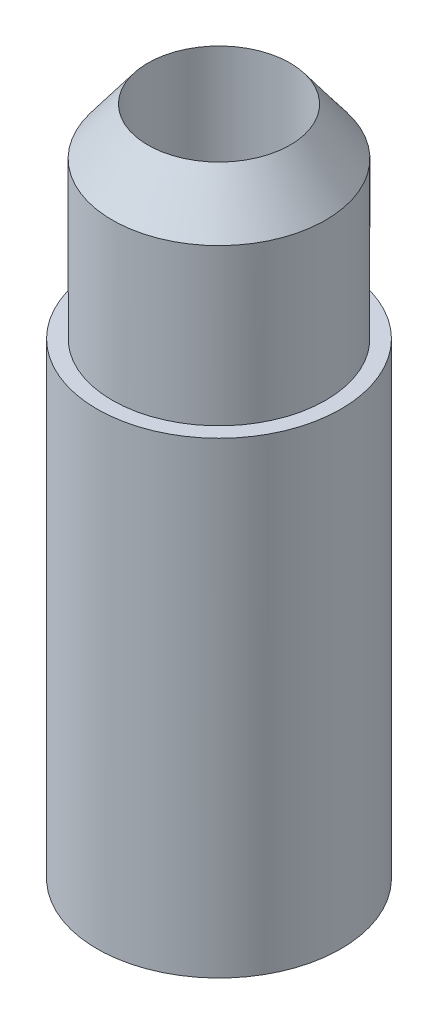
ISO-10303-21;
HEADER;
FILE_DESCRIPTION(('STEP AP214'),'2;1');
FILE_NAME('part.step','',(''),(''),'','','');
FILE_SCHEMA(('AUTOMOTIVE_DESIGN { 1 0 10303 214 1 1 1 1 }'));
ENDSEC;
DATA;
#1=APPLICATION_CONTEXT('core data for automotive mechanical design processes');
#2=APPLICATION_PROTOCOL_DEFINITION('international standard','automotive_design',2000,#1);
#3=PRODUCT_CONTEXT('',#1,'mechanical');
#4=PRODUCT('Part','Part','',(#3));
#5=PRODUCT_RELATED_PRODUCT_CATEGORY('part','',(#4));
#6=PRODUCT_DEFINITION_FORMATION('','',#4);
#7=PRODUCT_DEFINITION_CONTEXT('part definition',#1,'design');
#8=PRODUCT_DEFINITION('design','',#6,#7);
#9=PRODUCT_DEFINITION_SHAPE('','',#8);
#10=(LENGTH_UNIT() NAMED_UNIT(*) SI_UNIT(.MILLI.,.METRE.));
#11=(NAMED_UNIT(*) PLANE_ANGLE_UNIT() SI_UNIT($,.RADIAN.));
#12=(NAMED_UNIT(*) SI_UNIT($,.STERADIAN.) SOLID_ANGLE_UNIT());
#13=UNCERTAINTY_MEASURE_WITH_UNIT(LENGTH_MEASURE(1.E-05),#10,'distance_accuracy_value','');
#14=(GEOMETRIC_REPRESENTATION_CONTEXT(3) GLOBAL_UNCERTAINTY_ASSIGNED_CONTEXT((#13)) GLOBAL_UNIT_ASSIGNED_CONTEXT((#10,
#11,#12)) REPRESENTATION_CONTEXT('',''));
#15=CARTESIAN_POINT('',(0.,0.,0.));
#16=DIRECTION('',(0.,0.,1.));
#17=DIRECTION('',(1.,0.,0.));
#18=AXIS2_PLACEMENT_3D('',#15,#16,#17);
#19=CARTESIAN_POINT('',(0.,76.2,0.));
#20=DIRECTION('',(0.,-1.,0.));
#21=DIRECTION('',(0.,0.,-1.));
#22=AXIS2_PLACEMENT_3D('',#19,#20,#21);
#23=CYLINDRICAL_SURFACE('',#22,19.05);
#24=CARTESIAN_POINT('',(0.,76.2,0.));
#25=DIRECTION('',(0.,1.,0.));
#26=DIRECTION('',(0.,0.,1.));
#27=AXIS2_PLACEMENT_3D('',#24,#25,#26);
#28=CIRCLE('',#27,19.05);
#29=CARTESIAN_POINT('',(0.,76.2,19.05));
#30=VERTEX_POINT('',#29);
#31=EDGE_CURVE('E55',#30,#30,#28,.T.);
#32=ORIENTED_EDGE('',*,*,#31,.F.);
#33=EDGE_LOOP('',(#32));
#34=FACE_BOUND('',#33,.T.);
#35=CARTESIAN_POINT('',(0.,3.17499999999999,0.));
#36=DIRECTION('',(0.,-1.,0.));
#37=DIRECTION('',(0.,0.,-1.));
#38=AXIS2_PLACEMENT_3D('',#35,#36,#37);
#39=CIRCLE('',#38,19.05);
#40=CARTESIAN_POINT('',(0.,3.17499999999999,-19.05));
#41=VERTEX_POINT('',#40);
#42=EDGE_CURVE('E72',#41,#41,#39,.T.);
#43=ORIENTED_EDGE('',*,*,#42,.F.);
#44=EDGE_LOOP('',(#43));
#45=FACE_BOUND('',#44,.T.);
#46=ADVANCED_FACE('F47',(#34,#45),#23,.T.);
#47=CARTESIAN_POINT('',(0.,76.2,0.));
#48=DIRECTION('',(0.,-1.,0.));
#49=DIRECTION('',(0.,0.,-1.));
#50=AXIS2_PLACEMENT_3D('',#47,#48,#49);
#51=CYLINDRICAL_SURFACE('',#50,11.1125);
#52=CARTESIAN_POINT('',(0.,107.95,0.));
#53=DIRECTION('',(0.,-1.,0.));
#54=DIRECTION('',(0.,0.,-1.));
#55=AXIS2_PLACEMENT_3D('',#52,#53,#54);
#56=CIRCLE('',#55,11.1125);
#57=CARTESIAN_POINT('',(0.,107.95,-11.1125));
#58=VERTEX_POINT('',#57);
#59=EDGE_CURVE('E63',#58,#58,#56,.T.);
#60=ORIENTED_EDGE('',*,*,#59,.F.);
#61=EDGE_LOOP('',(#60));
#62=FACE_BOUND('',#61,.T.);
#63=CARTESIAN_POINT('',(0.,0.750684466478031,0.));
#64=DIRECTION('',(0.,1.,0.));
#65=DIRECTION('',(0.,0.,1.));
#66=AXIS2_PLACEMENT_3D('',#63,#64,#65);
#67=CIRCLE('',#66,11.1125);
#68=CARTESIAN_POINT('',(0.,0.750684466478031,11.1125));
#69=VERTEX_POINT('',#68);
#70=EDGE_CURVE('E50',#69,#69,#67,.F.);
#71=ORIENTED_EDGE('',*,*,#70,.T.);
#72=EDGE_LOOP('',(#71));
#73=FACE_BOUND('',#72,.T.);
#74=ADVANCED_FACE('F85',(#62,#73),#51,.F.);
#75=CARTESIAN_POINT('',(0.,76.2,0.));
#76=DIRECTION('',(0.,1.,0.));
#77=DIRECTION('',(0.,0.,1.));
#78=AXIS2_PLACEMENT_3D('',#75,#76,#77);
#79=PLANE('',#78);
#80=CARTESIAN_POINT('',(0.,76.2,0.));
#81=DIRECTION('',(0.,1.,0.));
#82=DIRECTION('',(0.,0.,1.));
#83=AXIS2_PLACEMENT_3D('',#80,#81,#82);
#84=CIRCLE('',#83,16.66875);
#85=CARTESIAN_POINT('',(0.,76.2,16.66875));
#86=VERTEX_POINT('',#85);
#87=EDGE_CURVE('E10',#86,#86,#84,.T.);
#88=ORIENTED_EDGE('',*,*,#87,.F.);
#89=EDGE_LOOP('',(#88));
#90=FACE_BOUND('',#89,.T.);
#91=ORIENTED_EDGE('',*,*,#31,.T.);
#92=EDGE_LOOP('',(#91));
#93=FACE_BOUND('',#92,.T.);
#94=ADVANCED_FACE('F102',(#90,#93),#79,.T.);
#95=CARTESIAN_POINT('',(0.,107.95,0.));
#96=DIRECTION('',(0.,-1.,0.));
#97=DIRECTION('',(0.,0.,-1.));
#98=AXIS2_PLACEMENT_3D('',#95,#96,#97);
#99=CYLINDRICAL_SURFACE('',#98,16.66875);
#100=CARTESIAN_POINT('',(0.,100.576607209871,0.));
#101=DIRECTION('',(0.,-1.,0.));
#102=DIRECTION('',(0.,0.,-1.));
#103=AXIS2_PLACEMENT_3D('',#100,#101,#102);
#104=CIRCLE('',#103,16.66875);
#105=CARTESIAN_POINT('',(0.,100.576607209871,-16.66875));
#106=VERTEX_POINT('',#105);
#107=EDGE_CURVE('E68',#106,#106,#104,.T.);
#108=ORIENTED_EDGE('',*,*,#107,.T.);
#109=EDGE_LOOP('',(#108));
#110=FACE_BOUND('',#109,.T.);
#111=ORIENTED_EDGE('',*,*,#87,.T.);
#112=EDGE_LOOP('',(#111));
#113=FACE_BOUND('',#112,.T.);
#114=ADVANCED_FACE('F94',(#110,#113),#99,.T.);
#115=CARTESIAN_POINT('',(0.,107.95,0.));
#116=DIRECTION('',(0.,-1.,0.));
#117=DIRECTION('',(0.,0.,-1.));
#118=AXIS2_PLACEMENT_3D('',#115,#116,#117);
#119=CONICAL_SURFACE('',#118,11.1125,0.645771823237896);
#120=ORIENTED_EDGE('',*,*,#107,.F.);
#121=EDGE_LOOP('',(#120));
#122=FACE_BOUND('',#121,.T.);
#123=ORIENTED_EDGE('',*,*,#59,.T.);
#124=EDGE_LOOP('',(#123));
#125=FACE_BOUND('',#124,.T.);
#126=ADVANCED_FACE('F89',(#122,#125),#119,.T.);
#127=CARTESIAN_POINT('',(0.,40.3086347794843,0.));
#128=DIRECTION('',(0.,-1.,0.));
#129=DIRECTION('',(0.,0.,-1.));
#130=AXIS2_PLACEMENT_3D('',#127,#128,#129);
#131=DEGENERATE_TOROIDAL_SURFACE('',#130,3.3694641083372,40.3086347794843,.T.);
#132=ORIENTED_EDGE('',*,*,#70,.F.);
#133=EDGE_LOOP('',(#132));
#134=FACE_BOUND('',#133,.T.);
#135=ORIENTED_EDGE('',*,*,#42,.T.);
#136=EDGE_LOOP('',(#135));
#137=FACE_BOUND('',#136,.T.);
#138=ADVANCED_FACE('F87',(#134,#137),#131,.T.);
#139=CLOSED_SHELL('',(#46,#74,#94,#114,#126,#138));
#140=MANIFOLD_SOLID_BREP('B2',#139);
#141=ADVANCED_BREP_SHAPE_REPRESENTATION('',(#18,#140),#14);
#142=SHAPE_DEFINITION_REPRESENTATION(#9,#141);
ENDSEC;
END-ISO-10303-21;
